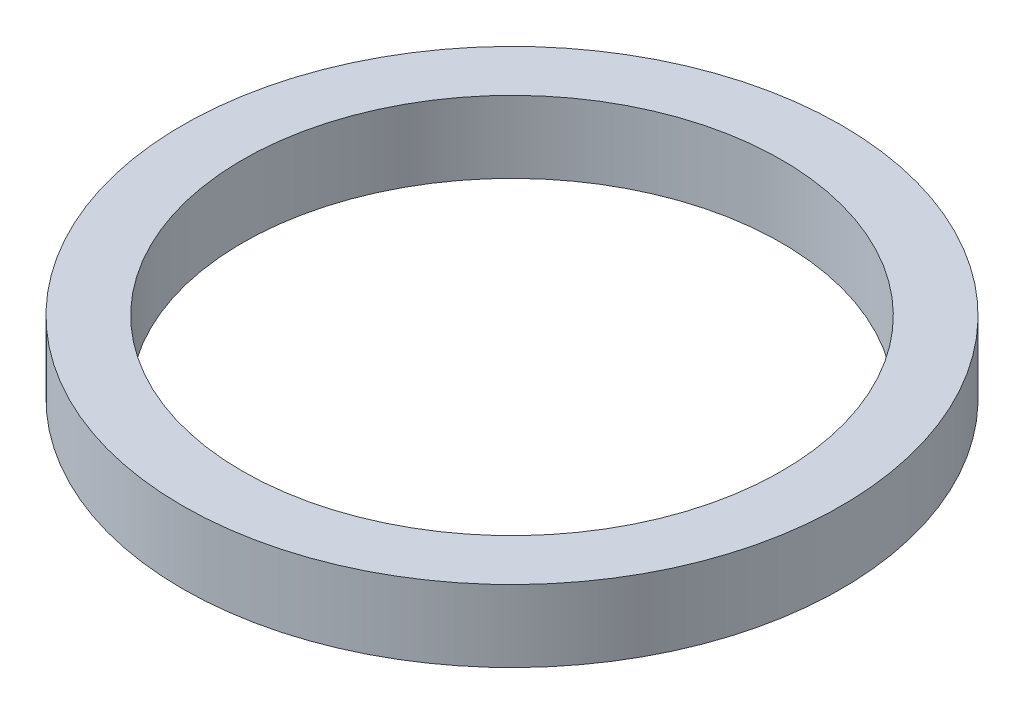
ISO-10303-21;
HEADER;
FILE_DESCRIPTION(('STEP AP214'),'2;1');
FILE_NAME('part.step','',(''),(''),'','','');
FILE_SCHEMA(('AUTOMOTIVE_DESIGN { 1 0 10303 214 1 1 1 1 }'));
ENDSEC;
DATA;
#1=APPLICATION_CONTEXT('core data for automotive mechanical design processes');
#2=APPLICATION_PROTOCOL_DEFINITION('international standard','automotive_design',2000,#1);
#3=PRODUCT_CONTEXT('',#1,'mechanical');
#4=PRODUCT('Part','Part','',(#3));
#5=PRODUCT_RELATED_PRODUCT_CATEGORY('part','',(#4));
#6=PRODUCT_DEFINITION_FORMATION('','',#4);
#7=PRODUCT_DEFINITION_CONTEXT('part definition',#1,'design');
#8=PRODUCT_DEFINITION('design','',#6,#7);
#9=PRODUCT_DEFINITION_SHAPE('','',#8);
#10=(LENGTH_UNIT() NAMED_UNIT(*) SI_UNIT(.MILLI.,.METRE.));
#11=(NAMED_UNIT(*) PLANE_ANGLE_UNIT() SI_UNIT($,.RADIAN.));
#12=(NAMED_UNIT(*) SI_UNIT($,.STERADIAN.) SOLID_ANGLE_UNIT());
#13=UNCERTAINTY_MEASURE_WITH_UNIT(LENGTH_MEASURE(1.E-05),#10,'distance_accuracy_value','');
#14=(GEOMETRIC_REPRESENTATION_CONTEXT(3) GLOBAL_UNCERTAINTY_ASSIGNED_CONTEXT((#13)) GLOBAL_UNIT_ASSIGNED_CONTEXT((#10,
#11,#12)) REPRESENTATION_CONTEXT('',''));
#15=CARTESIAN_POINT('',(0.,0.,0.));
#16=DIRECTION('',(0.,0.,1.));
#17=DIRECTION('',(1.,0.,0.));
#18=AXIS2_PLACEMENT_3D('',#15,#16,#17);
#19=CARTESIAN_POINT('',(0.,12.,0.));
#20=DIRECTION('',(0.,-1.,0.));
#21=DIRECTION('',(0.,0.,-1.));
#22=AXIS2_PLACEMENT_3D('',#19,#20,#21);
#23=CYLINDRICAL_SURFACE('',#22,55.);
#24=CARTESIAN_POINT('',(0.,12.,0.));
#25=DIRECTION('',(0.,1.,0.));
#26=DIRECTION('',(0.,0.,1.));
#27=AXIS2_PLACEMENT_3D('',#24,#25,#26);
#28=CIRCLE('',#27,55.);
#29=CARTESIAN_POINT('',(0.,12.,55.));
#30=VERTEX_POINT('',#29);
#31=EDGE_CURVE('E10',#30,#30,#28,.T.);
#32=ORIENTED_EDGE('',*,*,#31,.F.);
#33=EDGE_LOOP('',(#32));
#34=FACE_BOUND('',#33,.T.);
#35=CARTESIAN_POINT('',(0.,0.,0.));
#36=DIRECTION('',(0.,1.,0.));
#37=DIRECTION('',(0.,0.,1.));
#38=AXIS2_PLACEMENT_3D('',#35,#36,#37);
#39=CIRCLE('',#38,55.);
#40=CARTESIAN_POINT('',(0.,0.,55.));
#41=VERTEX_POINT('',#40);
#42=EDGE_CURVE('E37',#41,#41,#39,.T.);
#43=ORIENTED_EDGE('',*,*,#42,.T.);
#44=EDGE_LOOP('',(#43));
#45=FACE_BOUND('',#44,.T.);
#46=ADVANCED_FACE('F40',(#34,#45),#23,.T.);
#47=CARTESIAN_POINT('',(0.,12.,0.));
#48=DIRECTION('',(0.,1.,0.));
#49=DIRECTION('',(0.,0.,1.));
#50=AXIS2_PLACEMENT_3D('',#47,#48,#49);
#51=PLANE('',#50);
#52=CARTESIAN_POINT('',(0.,12.,0.));
#53=DIRECTION('',(0.,1.,0.));
#54=DIRECTION('',(0.,0.,1.));
#55=AXIS2_PLACEMENT_3D('',#52,#53,#54);
#56=CIRCLE('',#55,45.);
#57=CARTESIAN_POINT('',(0.,12.,45.));
#58=VERTEX_POINT('',#57);
#59=EDGE_CURVE('E50',#58,#58,#56,.T.);
#60=ORIENTED_EDGE('',*,*,#59,.F.);
#61=EDGE_LOOP('',(#60));
#62=FACE_BOUND('',#61,.T.);
#63=ORIENTED_EDGE('',*,*,#31,.T.);
#64=EDGE_LOOP('',(#63));
#65=FACE_BOUND('',#64,.T.);
#66=ADVANCED_FACE('F59',(#62,#65),#51,.T.);
#67=CARTESIAN_POINT('',(0.,0.,0.));
#68=DIRECTION('',(0.,1.,0.));
#69=DIRECTION('',(0.,0.,1.));
#70=AXIS2_PLACEMENT_3D('',#67,#68,#69);
#71=PLANE('',#70);
#72=CARTESIAN_POINT('',(0.,0.,0.));
#73=DIRECTION('',(0.,1.,0.));
#74=DIRECTION('',(0.,0.,1.));
#75=AXIS2_PLACEMENT_3D('',#72,#73,#74);
#76=CIRCLE('',#75,45.);
#77=CARTESIAN_POINT('',(0.,0.,45.));
#78=VERTEX_POINT('',#77);
#79=EDGE_CURVE('E47',#78,#78,#76,.T.);
#80=ORIENTED_EDGE('',*,*,#79,.T.);
#81=EDGE_LOOP('',(#80));
#82=FACE_BOUND('',#81,.T.);
#83=ORIENTED_EDGE('',*,*,#42,.F.);
#84=EDGE_LOOP('',(#83));
#85=FACE_BOUND('',#84,.T.);
#86=ADVANCED_FACE('F58',(#82,#85),#71,.F.);
#87=CARTESIAN_POINT('',(0.,12.,0.));
#88=DIRECTION('',(0.,-1.,0.));
#89=DIRECTION('',(0.,0.,-1.));
#90=AXIS2_PLACEMENT_3D('',#87,#88,#89);
#91=CYLINDRICAL_SURFACE('',#90,45.);
#92=ORIENTED_EDGE('',*,*,#59,.T.);
#93=EDGE_LOOP('',(#92));
#94=FACE_BOUND('',#93,.T.);
#95=ORIENTED_EDGE('',*,*,#79,.F.);
#96=EDGE_LOOP('',(#95));
#97=FACE_BOUND('',#96,.T.);
#98=ADVANCED_FACE('F54',(#94,#97),#91,.F.);
#99=CLOSED_SHELL('',(#46,#66,#86,#98));
#100=MANIFOLD_SOLID_BREP('B2',#99);
#101=ADVANCED_BREP_SHAPE_REPRESENTATION('',(#18,#100),#14);
#102=SHAPE_DEFINITION_REPRESENTATION(#9,#101);
ENDSEC;
END-ISO-10303-21;
